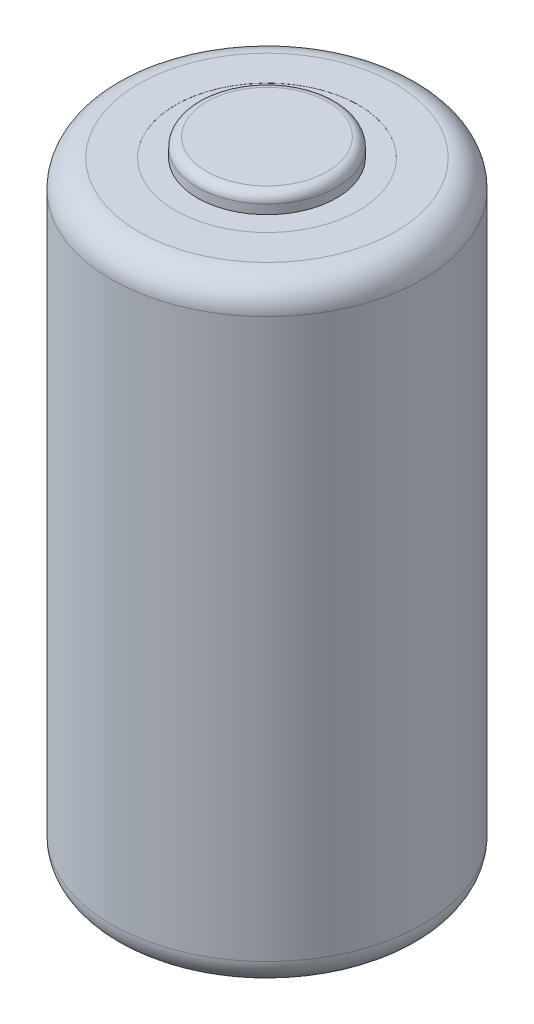
ISO-10303-21;
HEADER;
FILE_DESCRIPTION(('STEP AP214'),'2;1');
FILE_NAME('part.step','',(''),(''),'','','');
FILE_SCHEMA(('AUTOMOTIVE_DESIGN { 1 0 10303 214 1 1 1 1 }'));
ENDSEC;
DATA;
#1=APPLICATION_CONTEXT('core data for automotive mechanical design processes');
#2=APPLICATION_PROTOCOL_DEFINITION('international standard','automotive_design',2000,#1);
#3=PRODUCT_CONTEXT('',#1,'mechanical');
#4=PRODUCT('Part','Part','',(#3));
#5=PRODUCT_RELATED_PRODUCT_CATEGORY('part','',(#4));
#6=PRODUCT_DEFINITION_FORMATION('','',#4);
#7=PRODUCT_DEFINITION_CONTEXT('part definition',#1,'design');
#8=PRODUCT_DEFINITION('design','',#6,#7);
#9=PRODUCT_DEFINITION_SHAPE('','',#8);
#10=(LENGTH_UNIT() NAMED_UNIT(*) SI_UNIT(.MILLI.,.METRE.));
#11=(NAMED_UNIT(*) PLANE_ANGLE_UNIT() SI_UNIT($,.RADIAN.));
#12=(NAMED_UNIT(*) SI_UNIT($,.STERADIAN.) SOLID_ANGLE_UNIT());
#13=UNCERTAINTY_MEASURE_WITH_UNIT(LENGTH_MEASURE(1.E-05),#10,'distance_accuracy_value','');
#14=(GEOMETRIC_REPRESENTATION_CONTEXT(3) GLOBAL_UNCERTAINTY_ASSIGNED_CONTEXT((#13)) GLOBAL_UNIT_ASSIGNED_CONTEXT((#10,
#11,#12)) REPRESENTATION_CONTEXT('',''));
#15=CARTESIAN_POINT('',(0.,0.,0.));
#16=DIRECTION('',(0.,0.,1.));
#17=DIRECTION('',(1.,0.,0.));
#18=AXIS2_PLACEMENT_3D('',#15,#16,#17);
#19=CARTESIAN_POINT('',(0.,33.5,0.));
#20=DIRECTION('',(0.,1.,0.));
#21=DIRECTION('',(0.,0.,1.));
#22=AXIS2_PLACEMENT_3D('',#19,#20,#21);
#23=PLANE('',#22);
#24=CARTESIAN_POINT('',(0.,33.5,0.));
#25=DIRECTION('',(0.,1.,0.));
#26=DIRECTION('',(0.,0.,1.));
#27=AXIS2_PLACEMENT_3D('',#24,#25,#26);
#28=CIRCLE('',#27,5.);
#29=CARTESIAN_POINT('',(0.,33.5,5.));
#30=VERTEX_POINT('',#29);
#31=EDGE_CURVE('E59',#30,#30,#28,.T.);
#32=ORIENTED_EDGE('',*,*,#31,.F.);
#33=EDGE_LOOP('',(#32));
#34=FACE_BOUND('',#33,.T.);
#35=CARTESIAN_POINT('',(0.,33.5,0.));
#36=DIRECTION('',(0.,1.,0.));
#37=DIRECTION('',(0.,0.,1.));
#38=AXIS2_PLACEMENT_3D('',#35,#36,#37);
#39=CIRCLE('',#38,7.);
#40=CARTESIAN_POINT('',(0.,33.5,7.));
#41=VERTEX_POINT('',#40);
#42=EDGE_CURVE('E43',#41,#41,#39,.T.);
#43=ORIENTED_EDGE('',*,*,#42,.T.);
#44=EDGE_LOOP('',(#43));
#45=FACE_BOUND('',#44,.T.);
#46=ADVANCED_FACE('F32',(#34,#45),#23,.T.);
#47=CARTESIAN_POINT('',(0.,33.5,0.));
#48=DIRECTION('',(0.,-1.,0.));
#49=DIRECTION('',(0.,0.,-1.));
#50=AXIS2_PLACEMENT_3D('',#47,#48,#49);
#51=CYLINDRICAL_SURFACE('',#50,8.5);
#52=CARTESIAN_POINT('',(0.,1.5,0.));
#53=DIRECTION('',(0.,1.,0.));
#54=DIRECTION('',(0.,0.,1.));
#55=AXIS2_PLACEMENT_3D('',#52,#53,#54);
#56=CIRCLE('',#55,8.5);
#57=CARTESIAN_POINT('',(0.,1.5,8.5));
#58=VERTEX_POINT('',#57);
#59=EDGE_CURVE('E52',#58,#58,#56,.T.);
#60=ORIENTED_EDGE('',*,*,#59,.T.);
#61=EDGE_LOOP('',(#60));
#62=FACE_BOUND('',#61,.T.);
#63=CARTESIAN_POINT('',(0.,32.,0.));
#64=DIRECTION('',(0.,1.,0.));
#65=DIRECTION('',(0.,0.,1.));
#66=AXIS2_PLACEMENT_3D('',#63,#64,#65);
#67=CIRCLE('',#66,8.5);
#68=CARTESIAN_POINT('',(0.,32.,8.5));
#69=VERTEX_POINT('',#68);
#70=EDGE_CURVE('E55',#69,#69,#67,.F.);
#71=ORIENTED_EDGE('',*,*,#70,.T.);
#72=EDGE_LOOP('',(#71));
#73=FACE_BOUND('',#72,.T.);
#74=ADVANCED_FACE('F86',(#62,#73),#51,.T.);
#75=CARTESIAN_POINT('',(0.,0.,0.));
#76=DIRECTION('',(0.,1.,0.));
#77=DIRECTION('',(0.,0.,1.));
#78=AXIS2_PLACEMENT_3D('',#75,#76,#77);
#79=PLANE('',#78);
#80=CARTESIAN_POINT('',(0.,0.,0.));
#81=DIRECTION('',(0.,1.,0.));
#82=DIRECTION('',(0.,0.,1.));
#83=AXIS2_PLACEMENT_3D('',#80,#81,#82);
#84=CIRCLE('',#83,7.);
#85=CARTESIAN_POINT('',(0.,0.,7.));
#86=VERTEX_POINT('',#85);
#87=EDGE_CURVE('E47',#86,#86,#84,.F.);
#88=ORIENTED_EDGE('',*,*,#87,.T.);
#89=EDGE_LOOP('',(#88));
#90=FACE_BOUND('',#89,.T.);
#91=ADVANCED_FACE('F96',(#90),#79,.F.);
#92=CARTESIAN_POINT('',(0.,1.5,0.));
#93=DIRECTION('',(0.,1.,0.));
#94=DIRECTION('',(0.,0.,1.));
#95=AXIS2_PLACEMENT_3D('',#92,#93,#94);
#96=TOROIDAL_SURFACE('',#95,7.,1.5);
#97=ORIENTED_EDGE('',*,*,#87,.F.);
#98=EDGE_LOOP('',(#97));
#99=FACE_BOUND('',#98,.T.);
#100=ORIENTED_EDGE('',*,*,#59,.F.);
#101=EDGE_LOOP('',(#100));
#102=FACE_BOUND('',#101,.T.);
#103=ADVANCED_FACE('F91',(#99,#102),#96,.T.);
#104=CARTESIAN_POINT('',(0.,32.,0.));
#105=DIRECTION('',(0.,1.,0.));
#106=DIRECTION('',(0.,0.,1.));
#107=AXIS2_PLACEMENT_3D('',#104,#105,#106);
#108=TOROIDAL_SURFACE('',#107,7.,1.5);
#109=ORIENTED_EDGE('',*,*,#70,.F.);
#110=EDGE_LOOP('',(#109));
#111=FACE_BOUND('',#110,.T.);
#112=ORIENTED_EDGE('',*,*,#42,.F.);
#113=EDGE_LOOP('',(#112));
#114=FACE_BOUND('',#113,.T.);
#115=ADVANCED_FACE('F80',(#111,#114),#108,.T.);
#116=CARTESIAN_POINT('',(0.,33.495,0.));
#117=DIRECTION('',(0.,1.,0.));
#118=DIRECTION('',(0.,0.,1.));
#119=AXIS2_PLACEMENT_3D('',#116,#117,#118);
#120=CYLINDRICAL_SURFACE('',#119,5.);
#121=CARTESIAN_POINT('',(0.,33.495,0.));
#122=DIRECTION('',(0.,1.,0.));
#123=DIRECTION('',(0.,0.,1.));
#124=AXIS2_PLACEMENT_3D('',#121,#122,#123);
#125=CIRCLE('',#124,5.);
#126=CARTESIAN_POINT('',(0.,33.495,5.));
#127=VERTEX_POINT('',#126);
#128=EDGE_CURVE('E58',#127,#127,#125,.T.);
#129=ORIENTED_EDGE('',*,*,#128,.F.);
#130=EDGE_LOOP('',(#129));
#131=FACE_BOUND('',#130,.T.);
#132=ORIENTED_EDGE('',*,*,#31,.T.);
#133=EDGE_LOOP('',(#132));
#134=FACE_BOUND('',#133,.T.);
#135=ADVANCED_FACE('F74',(#131,#134),#120,.F.);
#136=CARTESIAN_POINT('',(0.,33.495,0.));
#137=DIRECTION('',(0.,1.,0.));
#138=DIRECTION('',(0.,0.,1.));
#139=AXIS2_PLACEMENT_3D('',#136,#137,#138);
#140=PLANE('',#139);
#141=CARTESIAN_POINT('',(0.,33.495,0.));
#142=DIRECTION('',(0.,1.,0.));
#143=DIRECTION('',(0.,0.,1.));
#144=AXIS2_PLACEMENT_3D('',#141,#142,#143);
#145=CIRCLE('',#144,3.7999885534321);
#146=CARTESIAN_POINT('',(0.,33.495,3.7999885534321));
#147=VERTEX_POINT('',#146);
#148=EDGE_CURVE('E62',#147,#147,#145,.T.);
#149=ORIENTED_EDGE('',*,*,#148,.F.);
#150=EDGE_LOOP('',(#149));
#151=FACE_BOUND('',#150,.T.);
#152=ORIENTED_EDGE('',*,*,#128,.T.);
#153=EDGE_LOOP('',(#152));
#154=FACE_BOUND('',#153,.T.);
#155=ADVANCED_FACE('F70',(#151,#154),#140,.T.);
#156=CARTESIAN_POINT('',(0.,34.5,0.));
#157=DIRECTION('',(0.,1.,0.));
#158=DIRECTION('',(0.,0.,1.));
#159=AXIS2_PLACEMENT_3D('',#156,#157,#158);
#160=PLANE('',#159);
#161=CARTESIAN_POINT('',(0.,34.5,0.));
#162=DIRECTION('',(0.,1.,0.));
#163=DIRECTION('',(0.,0.,1.));
#164=AXIS2_PLACEMENT_3D('',#161,#162,#163);
#165=CIRCLE('',#164,3.2999885534321);
#166=CARTESIAN_POINT('',(0.,34.5,3.2999885534321));
#167=VERTEX_POINT('',#166);
#168=EDGE_CURVE('E39',#167,#167,#165,.T.);
#169=ORIENTED_EDGE('',*,*,#168,.T.);
#170=EDGE_LOOP('',(#169));
#171=FACE_BOUND('',#170,.T.);
#172=ADVANCED_FACE('F73',(#171),#160,.T.);
#173=CARTESIAN_POINT('',(0.,34.,0.));
#174=DIRECTION('',(0.,1.,0.));
#175=DIRECTION('',(0.,0.,1.));
#176=AXIS2_PLACEMENT_3D('',#173,#174,#175);
#177=TOROIDAL_SURFACE('',#176,3.2999885534321,0.5);
#178=CARTESIAN_POINT('',(0.,34.,0.));
#179=DIRECTION('',(0.,1.,0.));
#180=DIRECTION('',(0.,0.,1.));
#181=AXIS2_PLACEMENT_3D('',#178,#179,#180);
#182=CIRCLE('',#181,3.7999885534321);
#183=CARTESIAN_POINT('',(0.,34.,3.7999885534321));
#184=VERTEX_POINT('',#183);
#185=EDGE_CURVE('E10',#184,#184,#182,.F.);
#186=ORIENTED_EDGE('',*,*,#185,.F.);
#187=EDGE_LOOP('',(#186));
#188=FACE_BOUND('',#187,.T.);
#189=ORIENTED_EDGE('',*,*,#168,.F.);
#190=EDGE_LOOP('',(#189));
#191=FACE_BOUND('',#190,.T.);
#192=ADVANCED_FACE('F34',(#188,#191),#177,.T.);
#193=CARTESIAN_POINT('',(0.,34.5,0.));
#194=DIRECTION('',(0.,-1.,0.));
#195=DIRECTION('',(0.,0.,-1.));
#196=AXIS2_PLACEMENT_3D('',#193,#194,#195);
#197=CYLINDRICAL_SURFACE('',#196,3.7999885534321);
#198=ORIENTED_EDGE('',*,*,#185,.T.);
#199=EDGE_LOOP('',(#198));
#200=FACE_BOUND('',#199,.T.);
#201=ORIENTED_EDGE('',*,*,#148,.T.);
#202=EDGE_LOOP('',(#201));
#203=FACE_BOUND('',#202,.T.);
#204=ADVANCED_FACE('F68',(#200,#203),#197,.T.);
#205=CLOSED_SHELL('',(#46,#74,#91,#103,#115,#135,#155,#172,#192,#204));
#206=MANIFOLD_SOLID_BREP('B2',#205);
#207=ADVANCED_BREP_SHAPE_REPRESENTATION('',(#18,#206),#14);
#208=SHAPE_DEFINITION_REPRESENTATION(#9,#207);
ENDSEC;
END-ISO-10303-21;
